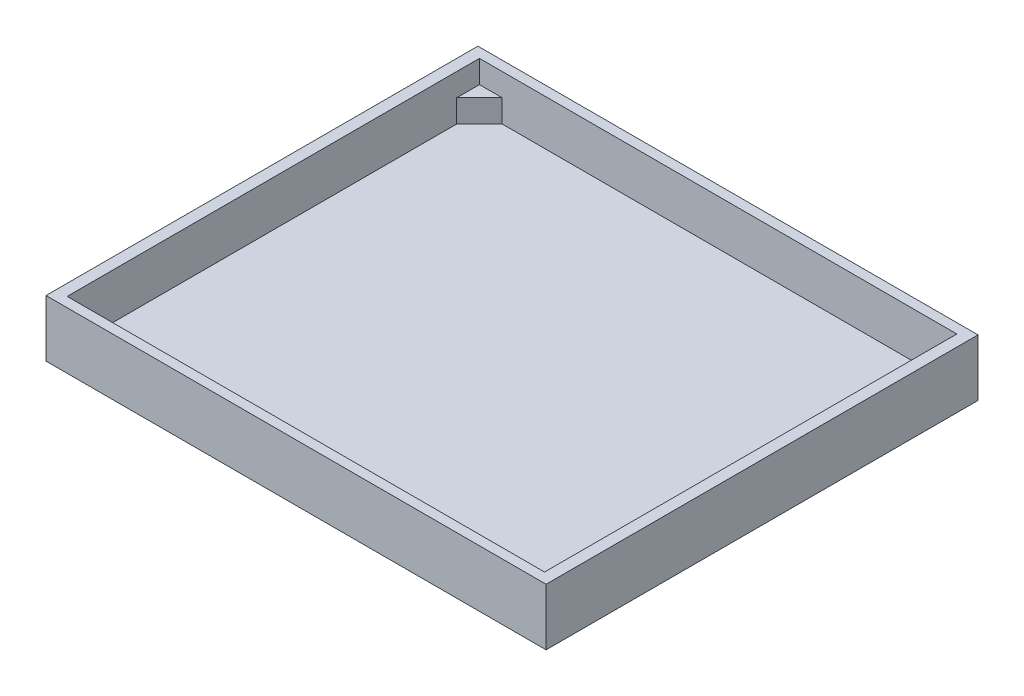
ISO-10303-21;
HEADER;
FILE_DESCRIPTION(('STEP AP214'),'2;1');
FILE_NAME('part.step','',(''),(''),'','','');
FILE_SCHEMA(('AUTOMOTIVE_DESIGN { 1 0 10303 214 1 1 1 1 }'));
ENDSEC;
DATA;
#1=APPLICATION_CONTEXT('core data for automotive mechanical design processes');
#2=APPLICATION_PROTOCOL_DEFINITION('international standard','automotive_design',2000,#1);
#3=PRODUCT_CONTEXT('',#1,'mechanical');
#4=PRODUCT('Part','Part','',(#3));
#5=PRODUCT_RELATED_PRODUCT_CATEGORY('part','',(#4));
#6=PRODUCT_DEFINITION_FORMATION('','',#4);
#7=PRODUCT_DEFINITION_CONTEXT('part definition',#1,'design');
#8=PRODUCT_DEFINITION('design','',#6,#7);
#9=PRODUCT_DEFINITION_SHAPE('','',#8);
#10=(LENGTH_UNIT() NAMED_UNIT(*) SI_UNIT(.MILLI.,.METRE.));
#11=(NAMED_UNIT(*) PLANE_ANGLE_UNIT() SI_UNIT($,.RADIAN.));
#12=(NAMED_UNIT(*) SI_UNIT($,.STERADIAN.) SOLID_ANGLE_UNIT());
#13=UNCERTAINTY_MEASURE_WITH_UNIT(LENGTH_MEASURE(1.E-05),#10,'distance_accuracy_value','');
#14=(GEOMETRIC_REPRESENTATION_CONTEXT(3) GLOBAL_UNCERTAINTY_ASSIGNED_CONTEXT((#13)) GLOBAL_UNIT_ASSIGNED_CONTEXT((#10,
#11,#12)) REPRESENTATION_CONTEXT('',''));
#15=CARTESIAN_POINT('',(0.,0.,0.));
#16=DIRECTION('',(0.,0.,1.));
#17=DIRECTION('',(1.,0.,0.));
#18=AXIS2_PLACEMENT_3D('',#15,#16,#17);
#19=CARTESIAN_POINT('',(0.,0.25,0.));
#20=DIRECTION('',(0.,-1.,0.));
#21=DIRECTION('',(0.,0.,-1.));
#22=AXIS2_PLACEMENT_3D('',#19,#20,#21);
#23=PLANE('',#22);
#24=DIRECTION('',(0.707106781186548,0.,0.707106781186548));
#25=VECTOR('',#24,1.);
#26=CARTESIAN_POINT('',(4.75,0.25,-4.53409090909091));
#27=LINE('',#26,#25);
#28=CARTESIAN_POINT('',(4.75,0.25,-4.53409090909091));
#29=VERTEX_POINT('',#28);
#30=CARTESIAN_POINT('',(5.25,0.25,-4.03409090909091));
#31=VERTEX_POINT('',#30);
#32=EDGE_CURVE('E166',#29,#31,#27,.T.);
#33=ORIENTED_EDGE('',*,*,#32,.F.);
#34=DIRECTION('',(-1.,0.,0.));
#35=VECTOR('',#34,1.);
#36=CARTESIAN_POINT('',(-5.25,0.25,-4.53409090909091));
#37=LINE('',#36,#35);
#38=CARTESIAN_POINT('',(-4.75,0.25,-4.53409090909091));
#39=VERTEX_POINT('',#38);
#40=EDGE_CURVE('E156',#29,#39,#37,.T.);
#41=ORIENTED_EDGE('',*,*,#40,.T.);
#42=DIRECTION('',(0.707106781186548,0.,-0.707106781186548));
#43=VECTOR('',#42,1.);
#44=CARTESIAN_POINT('',(-4.75,0.25,-4.53409090909091));
#45=LINE('',#44,#43);
#46=CARTESIAN_POINT('',(-5.25,0.25,-4.03409090909091));
#47=VERTEX_POINT('',#46);
#48=EDGE_CURVE('E201',#47,#39,#45,.T.);
#49=ORIENTED_EDGE('',*,*,#48,.F.);
#50=DIRECTION('',(0.,0.,1.));
#51=VECTOR('',#50,1.);
#52=CARTESIAN_POINT('',(-5.25,0.25,4.53409090909091));
#53=LINE('',#52,#51);
#54=CARTESIAN_POINT('',(-5.25,0.25,4.03409090909091));
#55=VERTEX_POINT('',#54);
#56=EDGE_CURVE('E232',#47,#55,#53,.T.);
#57=ORIENTED_EDGE('',*,*,#56,.T.);
#58=DIRECTION('',(-0.707106781186548,0.,-0.707106781186548));
#59=VECTOR('',#58,1.);
#60=CARTESIAN_POINT('',(-4.75,0.25,4.53409090909091));
#61=LINE('',#60,#59);
#62=CARTESIAN_POINT('',(-4.75,0.25,4.53409090909091));
#63=VERTEX_POINT('',#62);
#64=EDGE_CURVE('E184',#63,#55,#61,.T.);
#65=ORIENTED_EDGE('',*,*,#64,.F.);
#66=DIRECTION('',(1.,0.,0.));
#67=VECTOR('',#66,1.);
#68=CARTESIAN_POINT('',(-5.25,0.25,4.53409090909091));
#69=LINE('',#68,#67);
#70=CARTESIAN_POINT('',(4.75,0.25,4.53409090909091));
#71=VERTEX_POINT('',#70);
#72=EDGE_CURVE('E222',#63,#71,#69,.T.);
#73=ORIENTED_EDGE('',*,*,#72,.T.);
#74=DIRECTION('',(-0.707106781186548,0.,0.707106781186548));
#75=VECTOR('',#74,1.);
#76=CARTESIAN_POINT('',(4.75,0.25,4.53409090909091));
#77=LINE('',#76,#75);
#78=CARTESIAN_POINT('',(5.25,0.25,4.03409090909091));
#79=VERTEX_POINT('',#78);
#80=EDGE_CURVE('E159',#79,#71,#77,.T.);
#81=ORIENTED_EDGE('',*,*,#80,.F.);
#82=DIRECTION('',(0.,0.,-1.));
#83=VECTOR('',#82,1.);
#84=CARTESIAN_POINT('',(5.25,0.25,4.53409090909091));
#85=LINE('',#84,#83);
#86=EDGE_CURVE('E218',#79,#31,#85,.T.);
#87=ORIENTED_EDGE('',*,*,#86,.T.);
#88=EDGE_LOOP('',(#33,#41,#49,#57,#65,#73,#81,#87));
#89=FACE_BOUND('',#88,.T.);
#90=ADVANCED_FACE('F35',(#89),#23,.F.);
#91=CARTESIAN_POINT('',(5.25,1.25,4.53409090909091));
#92=DIRECTION('',(-1.,0.,0.));
#93=DIRECTION('',(0.,0.,1.));
#94=AXIS2_PLACEMENT_3D('',#91,#92,#93);
#95=PLANE('',#94);
#96=DIRECTION('',(0.,0.,-1.));
#97=VECTOR('',#96,1.);
#98=CARTESIAN_POINT('',(5.25,0.75,-4.53409090909091));
#99=LINE('',#98,#97);
#100=CARTESIAN_POINT('',(5.25,0.75,-4.03409090909091));
#101=VERTEX_POINT('',#100);
#102=CARTESIAN_POINT('',(5.25,0.75,-4.53409090909091));
#103=VERTEX_POINT('',#102);
#104=EDGE_CURVE('E50',#101,#103,#99,.T.);
#105=ORIENTED_EDGE('',*,*,#104,.F.);
#106=DIRECTION('',(0.,-1.,0.));
#107=VECTOR('',#106,1.);
#108=CARTESIAN_POINT('',(5.25,0.75,-4.03409090909091));
#109=LINE('',#108,#107);
#110=EDGE_CURVE('E55',#101,#31,#109,.T.);
#111=ORIENTED_EDGE('',*,*,#110,.T.);
#112=ORIENTED_EDGE('',*,*,#86,.F.);
#113=DIRECTION('',(0.,-1.,0.));
#114=VECTOR('',#113,1.);
#115=CARTESIAN_POINT('',(5.25,0.75,4.03409090909091));
#116=LINE('',#115,#114);
#117=CARTESIAN_POINT('',(5.25,0.75,4.03409090909091));
#118=VERTEX_POINT('',#117);
#119=EDGE_CURVE('E182',#118,#79,#116,.T.);
#120=ORIENTED_EDGE('',*,*,#119,.F.);
#121=DIRECTION('',(0.,0.,-1.));
#122=VECTOR('',#121,1.);
#123=CARTESIAN_POINT('',(5.25,0.75,4.53409090909091));
#124=LINE('',#123,#122);
#125=CARTESIAN_POINT('',(5.25,0.75,4.53409090909091));
#126=VERTEX_POINT('',#125);
#127=EDGE_CURVE('E174',#126,#118,#124,.T.);
#128=ORIENTED_EDGE('',*,*,#127,.F.);
#129=DIRECTION('',(0.,-1.,0.));
#130=VECTOR('',#129,1.);
#131=CARTESIAN_POINT('',(5.25,1.25,4.53409090909091));
#132=LINE('',#131,#130);
#133=CARTESIAN_POINT('',(5.25,1.25,4.53409090909091));
#134=VERTEX_POINT('',#133);
#135=EDGE_CURVE('E229',#134,#126,#132,.T.);
#136=ORIENTED_EDGE('',*,*,#135,.F.);
#137=DIRECTION('',(0.,0.,-1.));
#138=VECTOR('',#137,1.);
#139=CARTESIAN_POINT('',(5.25,1.25,4.53409090909091));
#140=LINE('',#139,#138);
#141=CARTESIAN_POINT('',(5.25,1.25,-4.53409090909091));
#142=VERTEX_POINT('',#141);
#143=EDGE_CURVE('E219',#134,#142,#140,.T.);
#144=ORIENTED_EDGE('',*,*,#143,.T.);
#145=DIRECTION('',(0.,-1.,0.));
#146=VECTOR('',#145,1.);
#147=CARTESIAN_POINT('',(5.25,1.25,-4.53409090909091));
#148=LINE('',#147,#146);
#149=EDGE_CURVE('E245',#142,#103,#148,.T.);
#150=ORIENTED_EDGE('',*,*,#149,.T.);
#151=EDGE_LOOP('',(#105,#111,#112,#120,#128,#136,#144,#150));
#152=FACE_BOUND('',#151,.T.);
#153=ADVANCED_FACE('F301',(#152),#95,.T.);
#154=CARTESIAN_POINT('',(-5.25,1.25,-4.53409090909091));
#155=DIRECTION('',(0.,0.,1.));
#156=DIRECTION('',(1.,0.,0.));
#157=AXIS2_PLACEMENT_3D('',#154,#155,#156);
#158=PLANE('',#157);
#159=ORIENTED_EDGE('',*,*,#40,.F.);
#160=DIRECTION('',(0.,-1.,0.));
#161=VECTOR('',#160,1.);
#162=CARTESIAN_POINT('',(4.75,0.75,-4.53409090909091));
#163=LINE('',#162,#161);
#164=CARTESIAN_POINT('',(4.75,0.75,-4.53409090909091));
#165=VERTEX_POINT('',#164);
#166=EDGE_CURVE('E149',#165,#29,#163,.T.);
#167=ORIENTED_EDGE('',*,*,#166,.F.);
#168=DIRECTION('',(-1.,0.,0.));
#169=VECTOR('',#168,1.);
#170=CARTESIAN_POINT('',(5.25,0.75,-4.53409090909091));
#171=LINE('',#170,#169);
#172=EDGE_CURVE('E154',#103,#165,#171,.T.);
#173=ORIENTED_EDGE('',*,*,#172,.F.);
#174=ORIENTED_EDGE('',*,*,#149,.F.);
#175=DIRECTION('',(-1.,0.,0.));
#176=VECTOR('',#175,1.);
#177=CARTESIAN_POINT('',(-5.25,1.25,-4.53409090909091));
#178=LINE('',#177,#176);
#179=CARTESIAN_POINT('',(-5.25,1.25,-4.53409090909091));
#180=VERTEX_POINT('',#179);
#181=EDGE_CURVE('E221',#142,#180,#178,.T.);
#182=ORIENTED_EDGE('',*,*,#181,.T.);
#183=DIRECTION('',(0.,-1.,0.));
#184=VECTOR('',#183,1.);
#185=CARTESIAN_POINT('',(-5.25,1.25,-4.53409090909091));
#186=LINE('',#185,#184);
#187=CARTESIAN_POINT('',(-5.25,0.75,-4.53409090909091));
#188=VERTEX_POINT('',#187);
#189=EDGE_CURVE('E242',#180,#188,#186,.T.);
#190=ORIENTED_EDGE('',*,*,#189,.T.);
#191=DIRECTION('',(-1.,0.,0.));
#192=VECTOR('',#191,1.);
#193=CARTESIAN_POINT('',(-5.25,0.75,-4.53409090909091));
#194=LINE('',#193,#192);
#195=CARTESIAN_POINT('',(-4.75,0.75,-4.53409090909091));
#196=VERTEX_POINT('',#195);
#197=EDGE_CURVE('E208',#196,#188,#194,.T.);
#198=ORIENTED_EDGE('',*,*,#197,.F.);
#199=DIRECTION('',(0.,-1.,0.));
#200=VECTOR('',#199,1.);
#201=CARTESIAN_POINT('',(-4.75,0.75,-4.53409090909091));
#202=LINE('',#201,#200);
#203=EDGE_CURVE('E211',#196,#39,#202,.T.);
#204=ORIENTED_EDGE('',*,*,#203,.T.);
#205=EDGE_LOOP('',(#159,#167,#173,#174,#182,#190,#198,#204));
#206=FACE_BOUND('',#205,.T.);
#207=ADVANCED_FACE('F151',(#206),#158,.T.);
#208=CARTESIAN_POINT('',(-5.25,1.25,4.53409090909091));
#209=DIRECTION('',(0.,0.,-1.));
#210=DIRECTION('',(-1.,0.,0.));
#211=AXIS2_PLACEMENT_3D('',#208,#209,#210);
#212=PLANE('',#211);
#213=DIRECTION('',(1.,0.,0.));
#214=VECTOR('',#213,1.);
#215=CARTESIAN_POINT('',(5.25,0.75,4.53409090909091));
#216=LINE('',#215,#214);
#217=CARTESIAN_POINT('',(4.75,0.75,4.53409090909091));
#218=VERTEX_POINT('',#217);
#219=EDGE_CURVE('E172',#218,#126,#216,.T.);
#220=ORIENTED_EDGE('',*,*,#219,.F.);
#221=DIRECTION('',(0.,-1.,0.));
#222=VECTOR('',#221,1.);
#223=CARTESIAN_POINT('',(4.75,0.75,4.53409090909091));
#224=LINE('',#223,#222);
#225=EDGE_CURVE('E178',#218,#71,#224,.T.);
#226=ORIENTED_EDGE('',*,*,#225,.T.);
#227=ORIENTED_EDGE('',*,*,#72,.F.);
#228=DIRECTION('',(0.,-1.,0.));
#229=VECTOR('',#228,1.);
#230=CARTESIAN_POINT('',(-4.75,0.75,4.53409090909091));
#231=LINE('',#230,#229);
#232=CARTESIAN_POINT('',(-4.75,0.75,4.53409090909091));
#233=VERTEX_POINT('',#232);
#234=EDGE_CURVE('E198',#233,#63,#231,.T.);
#235=ORIENTED_EDGE('',*,*,#234,.F.);
#236=DIRECTION('',(1.,0.,0.));
#237=VECTOR('',#236,1.);
#238=CARTESIAN_POINT('',(-5.25,0.75,4.53409090909091));
#239=LINE('',#238,#237);
#240=CARTESIAN_POINT('',(-5.25,0.75,4.53409090909091));
#241=VERTEX_POINT('',#240);
#242=EDGE_CURVE('E185',#241,#233,#239,.T.);
#243=ORIENTED_EDGE('',*,*,#242,.F.);
#244=DIRECTION('',(0.,-1.,0.));
#245=VECTOR('',#244,1.);
#246=CARTESIAN_POINT('',(-5.25,1.25,4.53409090909091));
#247=LINE('',#246,#245);
#248=CARTESIAN_POINT('',(-5.25,1.25,4.53409090909091));
#249=VERTEX_POINT('',#248);
#250=EDGE_CURVE('E239',#249,#241,#247,.T.);
#251=ORIENTED_EDGE('',*,*,#250,.F.);
#252=DIRECTION('',(1.,0.,0.));
#253=VECTOR('',#252,1.);
#254=CARTESIAN_POINT('',(-5.25,1.25,4.53409090909091));
#255=LINE('',#254,#253);
#256=EDGE_CURVE('E227',#249,#134,#255,.T.);
#257=ORIENTED_EDGE('',*,*,#256,.T.);
#258=ORIENTED_EDGE('',*,*,#135,.T.);
#259=EDGE_LOOP('',(#220,#226,#227,#235,#243,#251,#257,#258));
#260=FACE_BOUND('',#259,.T.);
#261=ADVANCED_FACE('F421',(#260),#212,.T.);
#262=CARTESIAN_POINT('',(-5.25,1.25,4.53409090909091));
#263=DIRECTION('',(1.,0.,0.));
#264=DIRECTION('',(0.,0.,-1.));
#265=AXIS2_PLACEMENT_3D('',#262,#263,#264);
#266=PLANE('',#265);
#267=DIRECTION('',(0.,0.,1.));
#268=VECTOR('',#267,1.);
#269=CARTESIAN_POINT('',(-5.25,0.75,4.53409090909091));
#270=LINE('',#269,#268);
#271=CARTESIAN_POINT('',(-5.25,0.75,4.03409090909091));
#272=VERTEX_POINT('',#271);
#273=EDGE_CURVE('E191',#272,#241,#270,.T.);
#274=ORIENTED_EDGE('',*,*,#273,.F.);
#275=DIRECTION('',(0.,-1.,0.));
#276=VECTOR('',#275,1.);
#277=CARTESIAN_POINT('',(-5.25,0.75,4.03409090909091));
#278=LINE('',#277,#276);
#279=EDGE_CURVE('E194',#272,#55,#278,.T.);
#280=ORIENTED_EDGE('',*,*,#279,.T.);
#281=ORIENTED_EDGE('',*,*,#56,.F.);
#282=DIRECTION('',(0.,-1.,0.));
#283=VECTOR('',#282,1.);
#284=CARTESIAN_POINT('',(-5.25,0.75,-4.03409090909091));
#285=LINE('',#284,#283);
#286=CARTESIAN_POINT('',(-5.25,0.75,-4.03409090909091));
#287=VERTEX_POINT('',#286);
#288=EDGE_CURVE('E215',#287,#47,#285,.T.);
#289=ORIENTED_EDGE('',*,*,#288,.F.);
#290=DIRECTION('',(0.,0.,1.));
#291=VECTOR('',#290,1.);
#292=CARTESIAN_POINT('',(-5.25,0.75,-4.53409090909091));
#293=LINE('',#292,#291);
#294=EDGE_CURVE('E202',#188,#287,#293,.T.);
#295=ORIENTED_EDGE('',*,*,#294,.F.);
#296=ORIENTED_EDGE('',*,*,#189,.F.);
#297=DIRECTION('',(0.,0.,1.));
#298=VECTOR('',#297,1.);
#299=CARTESIAN_POINT('',(-5.25,1.25,4.53409090909091));
#300=LINE('',#299,#298);
#301=EDGE_CURVE('E224',#180,#249,#300,.T.);
#302=ORIENTED_EDGE('',*,*,#301,.T.);
#303=ORIENTED_EDGE('',*,*,#250,.T.);
#304=EDGE_LOOP('',(#274,#280,#281,#289,#295,#296,#302,#303));
#305=FACE_BOUND('',#304,.T.);
#306=ADVANCED_FACE('F299',(#305),#266,.T.);
#307=CARTESIAN_POINT('',(5.5,0.25,4.75));
#308=DIRECTION('',(-1.,0.,0.));
#309=DIRECTION('',(0.,0.,1.));
#310=AXIS2_PLACEMENT_3D('',#307,#308,#309);
#311=PLANE('',#310);
#312=DIRECTION('',(0.,0.,-1.));
#313=VECTOR('',#312,1.);
#314=CARTESIAN_POINT('',(5.5,0.,4.75));
#315=LINE('',#314,#313);
#316=CARTESIAN_POINT('',(5.5,0.,4.75));
#317=VERTEX_POINT('',#316);
#318=CARTESIAN_POINT('',(5.5,0.,-4.75));
#319=VERTEX_POINT('',#318);
#320=EDGE_CURVE('E259',#317,#319,#315,.T.);
#321=ORIENTED_EDGE('',*,*,#320,.T.);
#322=DIRECTION('',(0.,-1.,0.));
#323=VECTOR('',#322,1.);
#324=CARTESIAN_POINT('',(5.5,0.25,-4.75));
#325=LINE('',#324,#323);
#326=CARTESIAN_POINT('',(5.5,1.25,-4.75));
#327=VERTEX_POINT('',#326);
#328=EDGE_CURVE('E11',#327,#319,#325,.T.);
#329=ORIENTED_EDGE('',*,*,#328,.F.);
#330=DIRECTION('',(0.,0.,-1.));
#331=VECTOR('',#330,1.);
#332=CARTESIAN_POINT('',(5.5,1.25,4.75));
#333=LINE('',#332,#331);
#334=CARTESIAN_POINT('',(5.5,1.25,4.75));
#335=VERTEX_POINT('',#334);
#336=EDGE_CURVE('E247',#335,#327,#333,.T.);
#337=ORIENTED_EDGE('',*,*,#336,.F.);
#338=DIRECTION('',(0.,-1.,0.));
#339=VECTOR('',#338,1.);
#340=CARTESIAN_POINT('',(5.5,0.25,4.75));
#341=LINE('',#340,#339);
#342=EDGE_CURVE('E268',#335,#317,#341,.T.);
#343=ORIENTED_EDGE('',*,*,#342,.T.);
#344=EDGE_LOOP('',(#321,#329,#337,#343));
#345=FACE_BOUND('',#344,.T.);
#346=ADVANCED_FACE('F37',(#345),#311,.F.);
#347=CARTESIAN_POINT('',(-5.5,0.25,-4.75));
#348=DIRECTION('',(0.,0.,1.));
#349=DIRECTION('',(1.,0.,0.));
#350=AXIS2_PLACEMENT_3D('',#347,#348,#349);
#351=PLANE('',#350);
#352=DIRECTION('',(-1.,0.,0.));
#353=VECTOR('',#352,1.);
#354=CARTESIAN_POINT('',(-5.5,0.,-4.75));
#355=LINE('',#354,#353);
#356=CARTESIAN_POINT('',(-5.5,0.,-4.75));
#357=VERTEX_POINT('',#356);
#358=EDGE_CURVE('E262',#319,#357,#355,.T.);
#359=ORIENTED_EDGE('',*,*,#358,.T.);
#360=DIRECTION('',(0.,-1.,0.));
#361=VECTOR('',#360,1.);
#362=CARTESIAN_POINT('',(-5.5,0.25,-4.75));
#363=LINE('',#362,#361);
#364=CARTESIAN_POINT('',(-5.5,1.25,-4.75));
#365=VERTEX_POINT('',#364);
#366=EDGE_CURVE('E43',#365,#357,#363,.T.);
#367=ORIENTED_EDGE('',*,*,#366,.F.);
#368=DIRECTION('',(-1.,0.,0.));
#369=VECTOR('',#368,1.);
#370=CARTESIAN_POINT('',(-5.5,1.25,-4.75));
#371=LINE('',#370,#369);
#372=EDGE_CURVE('E250',#327,#365,#371,.T.);
#373=ORIENTED_EDGE('',*,*,#372,.F.);
#374=ORIENTED_EDGE('',*,*,#328,.T.);
#375=EDGE_LOOP('',(#359,#367,#373,#374));
#376=FACE_BOUND('',#375,.T.);
#377=ADVANCED_FACE('F292',(#376),#351,.F.);
#378=CARTESIAN_POINT('',(-5.5,0.25,4.75));
#379=DIRECTION('',(1.,0.,0.));
#380=DIRECTION('',(0.,0.,-1.));
#381=AXIS2_PLACEMENT_3D('',#378,#379,#380);
#382=PLANE('',#381);
#383=DIRECTION('',(0.,0.,1.));
#384=VECTOR('',#383,1.);
#385=CARTESIAN_POINT('',(-5.5,0.,4.75));
#386=LINE('',#385,#384);
#387=CARTESIAN_POINT('',(-5.5,0.,4.75));
#388=VERTEX_POINT('',#387);
#389=EDGE_CURVE('E264',#357,#388,#386,.T.);
#390=ORIENTED_EDGE('',*,*,#389,.T.);
#391=DIRECTION('',(0.,-1.,0.));
#392=VECTOR('',#391,1.);
#393=CARTESIAN_POINT('',(-5.5,0.25,4.75));
#394=LINE('',#393,#392);
#395=CARTESIAN_POINT('',(-5.5,1.25,4.75));
#396=VERTEX_POINT('',#395);
#397=EDGE_CURVE('E271',#396,#388,#394,.T.);
#398=ORIENTED_EDGE('',*,*,#397,.F.);
#399=DIRECTION('',(0.,0.,1.));
#400=VECTOR('',#399,1.);
#401=CARTESIAN_POINT('',(-5.5,1.25,4.75));
#402=LINE('',#401,#400);
#403=EDGE_CURVE('E253',#365,#396,#402,.T.);
#404=ORIENTED_EDGE('',*,*,#403,.F.);
#405=ORIENTED_EDGE('',*,*,#366,.T.);
#406=EDGE_LOOP('',(#390,#398,#404,#405));
#407=FACE_BOUND('',#406,.T.);
#408=ADVANCED_FACE('F277',(#407),#382,.F.);
#409=CARTESIAN_POINT('',(-5.5,0.25,4.75));
#410=DIRECTION('',(0.,0.,-1.));
#411=DIRECTION('',(-1.,0.,0.));
#412=AXIS2_PLACEMENT_3D('',#409,#410,#411);
#413=PLANE('',#412);
#414=DIRECTION('',(1.,0.,0.));
#415=VECTOR('',#414,1.);
#416=CARTESIAN_POINT('',(-5.5,0.,4.75));
#417=LINE('',#416,#415);
#418=EDGE_CURVE('E266',#388,#317,#417,.T.);
#419=ORIENTED_EDGE('',*,*,#418,.T.);
#420=ORIENTED_EDGE('',*,*,#342,.F.);
#421=DIRECTION('',(1.,0.,0.));
#422=VECTOR('',#421,1.);
#423=CARTESIAN_POINT('',(-5.5,1.25,4.75));
#424=LINE('',#423,#422);
#425=EDGE_CURVE('E256',#396,#335,#424,.T.);
#426=ORIENTED_EDGE('',*,*,#425,.F.);
#427=ORIENTED_EDGE('',*,*,#397,.T.);
#428=EDGE_LOOP('',(#419,#420,#426,#427));
#429=FACE_BOUND('',#428,.T.);
#430=ADVANCED_FACE('F285',(#429),#413,.F.);
#431=CARTESIAN_POINT('',(0.,0.,0.));
#432=DIRECTION('',(0.,-1.,0.));
#433=DIRECTION('',(0.,0.,-1.));
#434=AXIS2_PLACEMENT_3D('',#431,#432,#433);
#435=PLANE('',#434);
#436=ORIENTED_EDGE('',*,*,#320,.F.);
#437=ORIENTED_EDGE('',*,*,#418,.F.);
#438=ORIENTED_EDGE('',*,*,#389,.F.);
#439=ORIENTED_EDGE('',*,*,#358,.F.);
#440=EDGE_LOOP('',(#436,#437,#438,#439));
#441=FACE_BOUND('',#440,.T.);
#442=ADVANCED_FACE('F283',(#441),#435,.T.);
#443=CARTESIAN_POINT('',(0.,1.25,0.));
#444=DIRECTION('',(0.,-1.,0.));
#445=DIRECTION('',(0.,0.,-1.));
#446=AXIS2_PLACEMENT_3D('',#443,#444,#445);
#447=PLANE('',#446);
#448=ORIENTED_EDGE('',*,*,#336,.T.);
#449=ORIENTED_EDGE('',*,*,#372,.T.);
#450=ORIENTED_EDGE('',*,*,#403,.T.);
#451=ORIENTED_EDGE('',*,*,#425,.T.);
#452=EDGE_LOOP('',(#448,#449,#450,#451));
#453=FACE_BOUND('',#452,.T.);
#454=ORIENTED_EDGE('',*,*,#143,.F.);
#455=ORIENTED_EDGE('',*,*,#256,.F.);
#456=ORIENTED_EDGE('',*,*,#301,.F.);
#457=ORIENTED_EDGE('',*,*,#181,.F.);
#458=EDGE_LOOP('',(#454,#455,#456,#457));
#459=FACE_BOUND('',#458,.T.);
#460=ADVANCED_FACE('F290',(#453,#459),#447,.F.);
#461=CARTESIAN_POINT('',(-4.75,0.75,-4.53409090909091));
#462=DIRECTION('',(-0.707106781186548,0.,-0.707106781186548));
#463=DIRECTION('',(-0.707106781186548,0.,0.707106781186548));
#464=AXIS2_PLACEMENT_3D('',#461,#462,#463);
#465=PLANE('',#464);
#466=ORIENTED_EDGE('',*,*,#48,.T.);
#467=ORIENTED_EDGE('',*,*,#203,.F.);
#468=DIRECTION('',(0.707106781186548,0.,-0.707106781186548));
#469=VECTOR('',#468,1.);
#470=CARTESIAN_POINT('',(-4.75,0.75,-4.53409090909091));
#471=LINE('',#470,#469);
#472=EDGE_CURVE('E205',#287,#196,#471,.T.);
#473=ORIENTED_EDGE('',*,*,#472,.F.);
#474=ORIENTED_EDGE('',*,*,#288,.T.);
#475=EDGE_LOOP('',(#466,#467,#473,#474));
#476=FACE_BOUND('',#475,.T.);
#477=ADVANCED_FACE('F328',(#476),#465,.F.);
#478=CARTESIAN_POINT('',(0.,0.75,0.));
#479=DIRECTION('',(0.,1.,0.));
#480=DIRECTION('',(0.,0.,1.));
#481=AXIS2_PLACEMENT_3D('',#478,#479,#480);
#482=PLANE('',#481);
#483=ORIENTED_EDGE('',*,*,#294,.T.);
#484=ORIENTED_EDGE('',*,*,#472,.T.);
#485=ORIENTED_EDGE('',*,*,#197,.T.);
#486=EDGE_LOOP('',(#483,#484,#485));
#487=FACE_BOUND('',#486,.T.);
#488=ADVANCED_FACE('F334',(#487),#482,.T.);
#489=CARTESIAN_POINT('',(-4.75,0.75,4.53409090909091));
#490=DIRECTION('',(-0.707106781186548,0.,0.707106781186548));
#491=DIRECTION('',(0.707106781186548,0.,0.707106781186548));
#492=AXIS2_PLACEMENT_3D('',#489,#490,#491);
#493=PLANE('',#492);
#494=ORIENTED_EDGE('',*,*,#64,.T.);
#495=ORIENTED_EDGE('',*,*,#279,.F.);
#496=DIRECTION('',(-0.707106781186548,0.,-0.707106781186548));
#497=VECTOR('',#496,1.);
#498=CARTESIAN_POINT('',(-4.75,0.75,4.53409090909091));
#499=LINE('',#498,#497);
#500=EDGE_CURVE('E188',#233,#272,#499,.T.);
#501=ORIENTED_EDGE('',*,*,#500,.F.);
#502=ORIENTED_EDGE('',*,*,#234,.T.);
#503=EDGE_LOOP('',(#494,#495,#501,#502));
#504=FACE_BOUND('',#503,.T.);
#505=ADVANCED_FACE('F343',(#504),#493,.F.);
#506=CARTESIAN_POINT('',(0.,0.75,0.));
#507=DIRECTION('',(0.,1.,0.));
#508=DIRECTION('',(0.,0.,1.));
#509=AXIS2_PLACEMENT_3D('',#506,#507,#508);
#510=PLANE('',#509);
#511=ORIENTED_EDGE('',*,*,#242,.T.);
#512=ORIENTED_EDGE('',*,*,#500,.T.);
#513=ORIENTED_EDGE('',*,*,#273,.T.);
#514=EDGE_LOOP('',(#511,#512,#513));
#515=FACE_BOUND('',#514,.T.);
#516=ADVANCED_FACE('F351',(#515),#510,.T.);
#517=CARTESIAN_POINT('',(4.75,0.75,4.53409090909091));
#518=DIRECTION('',(0.707106781186548,0.,0.707106781186548));
#519=DIRECTION('',(0.707106781186548,0.,-0.707106781186548));
#520=AXIS2_PLACEMENT_3D('',#517,#518,#519);
#521=PLANE('',#520);
#522=ORIENTED_EDGE('',*,*,#80,.T.);
#523=ORIENTED_EDGE('',*,*,#225,.F.);
#524=DIRECTION('',(-0.707106781186548,0.,0.707106781186548));
#525=VECTOR('',#524,1.);
#526=CARTESIAN_POINT('',(4.75,0.75,4.53409090909091));
#527=LINE('',#526,#525);
#528=EDGE_CURVE('E176',#118,#218,#527,.T.);
#529=ORIENTED_EDGE('',*,*,#528,.F.);
#530=ORIENTED_EDGE('',*,*,#119,.T.);
#531=EDGE_LOOP('',(#522,#523,#529,#530));
#532=FACE_BOUND('',#531,.T.);
#533=ADVANCED_FACE('F359',(#532),#521,.F.);
#534=CARTESIAN_POINT('',(0.,0.75,0.));
#535=DIRECTION('',(0.,-1.,0.));
#536=DIRECTION('',(0.,0.,-1.));
#537=AXIS2_PLACEMENT_3D('',#534,#535,#536);
#538=PLANE('',#537);
#539=ORIENTED_EDGE('',*,*,#219,.T.);
#540=ORIENTED_EDGE('',*,*,#127,.T.);
#541=ORIENTED_EDGE('',*,*,#528,.T.);
#542=EDGE_LOOP('',(#539,#540,#541));
#543=FACE_BOUND('',#542,.T.);
#544=ADVANCED_FACE('F367',(#543),#538,.F.);
#545=CARTESIAN_POINT('',(4.75,0.75,-4.53409090909091));
#546=DIRECTION('',(0.707106781186548,0.,-0.707106781186548));
#547=DIRECTION('',(-0.707106781186548,0.,-0.707106781186548));
#548=AXIS2_PLACEMENT_3D('',#545,#546,#547);
#549=PLANE('',#548);
#550=ORIENTED_EDGE('',*,*,#32,.T.);
#551=ORIENTED_EDGE('',*,*,#110,.F.);
#552=DIRECTION('',(0.707106781186548,0.,0.707106781186548));
#553=VECTOR('',#552,1.);
#554=CARTESIAN_POINT('',(4.75,0.75,-4.53409090909091));
#555=LINE('',#554,#553);
#556=EDGE_CURVE('E161',#165,#101,#555,.T.);
#557=ORIENTED_EDGE('',*,*,#556,.F.);
#558=ORIENTED_EDGE('',*,*,#166,.T.);
#559=EDGE_LOOP('',(#550,#551,#557,#558));
#560=FACE_BOUND('',#559,.T.);
#561=ADVANCED_FACE('F162',(#560),#549,.F.);
#562=CARTESIAN_POINT('',(0.,0.75,0.));
#563=DIRECTION('',(0.,1.,0.));
#564=DIRECTION('',(0.,0.,1.));
#565=AXIS2_PLACEMENT_3D('',#562,#563,#564);
#566=PLANE('',#565);
#567=ORIENTED_EDGE('',*,*,#172,.T.);
#568=ORIENTED_EDGE('',*,*,#556,.T.);
#569=ORIENTED_EDGE('',*,*,#104,.T.);
#570=EDGE_LOOP('',(#567,#568,#569));
#571=FACE_BOUND('',#570,.T.);
#572=ADVANCED_FACE('F165',(#571),#566,.T.);
#573=CLOSED_SHELL('',(#90,#153,#207,#261,#306,#346,#377,#408,#430,#442,#460,#477,#488,#505,#516,
#533,#544,#561,#572));
#574=MANIFOLD_SOLID_BREP('B2',#573);
#575=ADVANCED_BREP_SHAPE_REPRESENTATION('',(#18,#574),#14);
#576=SHAPE_DEFINITION_REPRESENTATION(#9,#575);
ENDSEC;
END-ISO-10303-21;
